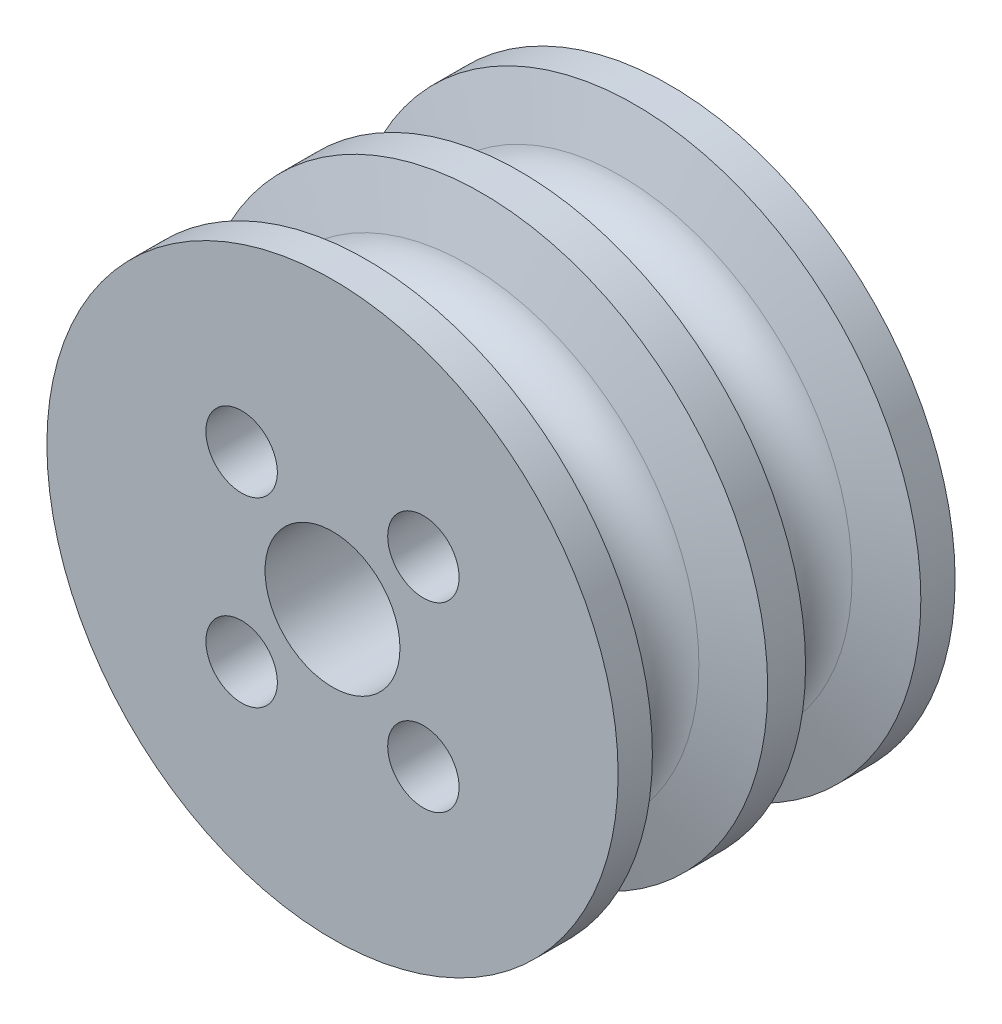
ISO-10303-21;
HEADER;
FILE_DESCRIPTION(('STEP AP214'),'2;1');
FILE_NAME('part.step','',(''),(''),'','','');
FILE_SCHEMA(('AUTOMOTIVE_DESIGN { 1 0 10303 214 1 1 1 1 }'));
ENDSEC;
DATA;
#1=APPLICATION_CONTEXT('core data for automotive mechanical design processes');
#2=APPLICATION_PROTOCOL_DEFINITION('international standard','automotive_design',2000,#1);
#3=PRODUCT_CONTEXT('',#1,'mechanical');
#4=PRODUCT('Part','Part','',(#3));
#5=PRODUCT_RELATED_PRODUCT_CATEGORY('part','',(#4));
#6=PRODUCT_DEFINITION_FORMATION('','',#4);
#7=PRODUCT_DEFINITION_CONTEXT('part definition',#1,'design');
#8=PRODUCT_DEFINITION('design','',#6,#7);
#9=PRODUCT_DEFINITION_SHAPE('','',#8);
#10=(LENGTH_UNIT() NAMED_UNIT(*) SI_UNIT(.MILLI.,.METRE.));
#11=(NAMED_UNIT(*) PLANE_ANGLE_UNIT() SI_UNIT($,.RADIAN.));
#12=(NAMED_UNIT(*) SI_UNIT($,.STERADIAN.) SOLID_ANGLE_UNIT());
#13=UNCERTAINTY_MEASURE_WITH_UNIT(LENGTH_MEASURE(1.E-05),#10,'distance_accuracy_value','');
#14=(GEOMETRIC_REPRESENTATION_CONTEXT(3) GLOBAL_UNCERTAINTY_ASSIGNED_CONTEXT((#13)) GLOBAL_UNIT_ASSIGNED_CONTEXT((#10,
#11,#12)) REPRESENTATION_CONTEXT('',''));
#15=CARTESIAN_POINT('',(0.,0.,0.));
#16=DIRECTION('',(0.,0.,1.));
#17=DIRECTION('',(1.,0.,0.));
#18=AXIS2_PLACEMENT_3D('',#15,#16,#17);
#19=CARTESIAN_POINT('',(0.,0.,3.4050435850451));
#20=DIRECTION('',(0.,0.,1.));
#21=DIRECTION('',(1.,0.,0.));
#22=AXIS2_PLACEMENT_3D('',#19,#20,#21);
#23=TOROIDAL_SURFACE('',#22,10.8011479498745,1.984375);
#24=CARTESIAN_POINT('',(0.,0.,5.32180264658747));
#25=DIRECTION('',(0.,0.,1.));
#26=DIRECTION('',(1.,0.,0.));
#27=AXIS2_PLACEMENT_3D('',#24,#25,#26);
#28=CIRCLE('',#27,10.2875539072492);
#29=CARTESIAN_POINT('',(10.2875539072492,0.,5.32180264658747));
#30=VERTEX_POINT('',#29);
#31=EDGE_CURVE('E10',#30,#30,#28,.T.);
#32=ORIENTED_EDGE('',*,*,#31,.F.);
#33=EDGE_LOOP('',(#32));
#34=FACE_BOUND('',#33,.T.);
#35=CARTESIAN_POINT('',(0.,0.,1.48828452350272));
#36=DIRECTION('',(0.,0.,1.));
#37=DIRECTION('',(1.,0.,0.));
#38=AXIS2_PLACEMENT_3D('',#35,#36,#37);
#39=CIRCLE('',#38,10.2875539072492);
#40=CARTESIAN_POINT('',(10.2875539072492,0.,1.48828452350272));
#41=VERTEX_POINT('',#40);
#42=EDGE_CURVE('E77',#41,#41,#39,.T.);
#43=ORIENTED_EDGE('',*,*,#42,.T.);
#44=EDGE_LOOP('',(#43));
#45=FACE_BOUND('',#44,.T.);
#46=ADVANCED_FACE('F31',(#34,#45),#23,.F.);
#47=CARTESIAN_POINT('',(0.,0.,5.32180264658747));
#48=DIRECTION('',(0.,0.,1.));
#49=DIRECTION('',(1.,0.,0.));
#50=AXIS2_PLACEMENT_3D('',#47,#48,#49);
#51=CONICAL_SURFACE('',#50,10.2875539072492,1.30899693899575);
#52=CARTESIAN_POINT('',(0.,0.,5.96821562892365));
#53=DIRECTION('',(0.,0.,1.));
#54=DIRECTION('',(1.,0.,0.));
#55=AXIS2_PLACEMENT_3D('',#52,#53,#54);
#56=CIRCLE('',#55,12.7);
#57=CARTESIAN_POINT('',(12.7,0.,5.96821562892365));
#58=VERTEX_POINT('',#57);
#59=EDGE_CURVE('E37',#58,#58,#56,.T.);
#60=ORIENTED_EDGE('',*,*,#59,.F.);
#61=EDGE_LOOP('',(#60));
#62=FACE_BOUND('',#61,.T.);
#63=ORIENTED_EDGE('',*,*,#31,.T.);
#64=EDGE_LOOP('',(#63));
#65=FACE_BOUND('',#64,.T.);
#66=ADVANCED_FACE('F149',(#62,#65),#51,.T.);
#67=CARTESIAN_POINT('',(0.,0.,0.));
#68=DIRECTION('',(0.,0.,1.));
#69=DIRECTION('',(1.,0.,0.));
#70=AXIS2_PLACEMENT_3D('',#67,#68,#69);
#71=CYLINDRICAL_SURFACE('',#70,12.7);
#72=CARTESIAN_POINT('',(0.,0.,7.49221562892365));
#73=DIRECTION('',(0.,0.,1.));
#74=DIRECTION('',(1.,0.,0.));
#75=AXIS2_PLACEMENT_3D('',#72,#73,#74);
#76=CIRCLE('',#75,12.7);
#77=CARTESIAN_POINT('',(12.7,0.,7.49221562892365));
#78=VERTEX_POINT('',#77);
#79=EDGE_CURVE('E41',#78,#78,#76,.T.);
#80=ORIENTED_EDGE('',*,*,#79,.F.);
#81=EDGE_LOOP('',(#80));
#82=FACE_BOUND('',#81,.T.);
#83=ORIENTED_EDGE('',*,*,#59,.T.);
#84=EDGE_LOOP('',(#83));
#85=FACE_BOUND('',#84,.T.);
#86=ADVANCED_FACE('F143',(#82,#85),#71,.T.);
#87=CARTESIAN_POINT('',(0.,12.7,7.49221562892365));
#88=DIRECTION('',(0.,0.,-1.));
#89=DIRECTION('',(-1.,0.,0.));
#90=AXIS2_PLACEMENT_3D('',#87,#88,#89);
#91=PLANE('',#90);
#92=CARTESIAN_POINT('',(4.04111525448112,-4.04111525448112,7.49221562892365));
#93=DIRECTION('',(0.,0.,-1.));
#94=DIRECTION('',(-1.,0.,0.));
#95=AXIS2_PLACEMENT_3D('',#92,#93,#94);
#96=CIRCLE('',#95,1.5875);
#97=CARTESIAN_POINT('',(2.45361525448112,-4.04111525448112,7.49221562892365));
#98=VERTEX_POINT('',#97);
#99=EDGE_CURVE('E86',#98,#98,#96,.F.);
#100=ORIENTED_EDGE('',*,*,#99,.F.);
#101=EDGE_LOOP('',(#100));
#102=FACE_BOUND('',#101,.T.);
#103=CARTESIAN_POINT('',(-4.04111525448112,-4.04111525448112,7.49221562892365));
#104=DIRECTION('',(0.,0.,-1.));
#105=DIRECTION('',(-1.,0.,0.));
#106=AXIS2_PLACEMENT_3D('',#103,#104,#105);
#107=CIRCLE('',#106,1.5875);
#108=CARTESIAN_POINT('',(-5.62861525448112,-4.04111525448112,7.49221562892365));
#109=VERTEX_POINT('',#108);
#110=EDGE_CURVE('E94',#109,#109,#107,.F.);
#111=ORIENTED_EDGE('',*,*,#110,.F.);
#112=EDGE_LOOP('',(#111));
#113=FACE_BOUND('',#112,.T.);
#114=CARTESIAN_POINT('',(-4.04111525448112,4.04111525448112,7.49221562892365));
#115=DIRECTION('',(0.,0.,-1.));
#116=DIRECTION('',(-1.,0.,0.));
#117=AXIS2_PLACEMENT_3D('',#114,#115,#116);
#118=CIRCLE('',#117,1.5875);
#119=CARTESIAN_POINT('',(-5.62861525448112,4.04111525448112,7.49221562892365));
#120=VERTEX_POINT('',#119);
#121=EDGE_CURVE('E87',#120,#120,#118,.F.);
#122=ORIENTED_EDGE('',*,*,#121,.F.);
#123=EDGE_LOOP('',(#122));
#124=FACE_BOUND('',#123,.T.);
#125=CARTESIAN_POINT('',(4.04111525448112,4.04111525448112,7.49221562892365));
#126=DIRECTION('',(0.,0.,-1.));
#127=DIRECTION('',(-1.,0.,0.));
#128=AXIS2_PLACEMENT_3D('',#125,#126,#127);
#129=CIRCLE('',#128,1.5875);
#130=CARTESIAN_POINT('',(2.45361525448112,4.04111525448112,7.49221562892365));
#131=VERTEX_POINT('',#130);
#132=EDGE_CURVE('E80',#131,#131,#129,.F.);
#133=ORIENTED_EDGE('',*,*,#132,.F.);
#134=EDGE_LOOP('',(#133));
#135=FACE_BOUND('',#134,.T.);
#136=CARTESIAN_POINT('',(0.,0.,7.49221562892365));
#137=DIRECTION('',(0.,0.,1.));
#138=DIRECTION('',(1.,0.,0.));
#139=AXIS2_PLACEMENT_3D('',#136,#137,#138);
#140=CIRCLE('',#139,3.);
#141=CARTESIAN_POINT('',(3.,0.,7.49221562892365));
#142=VERTEX_POINT('',#141);
#143=EDGE_CURVE('E45',#142,#142,#140,.T.);
#144=ORIENTED_EDGE('',*,*,#143,.F.);
#145=EDGE_LOOP('',(#144));
#146=FACE_BOUND('',#145,.T.);
#147=ORIENTED_EDGE('',*,*,#79,.T.);
#148=EDGE_LOOP('',(#147));
#149=FACE_BOUND('',#148,.T.);
#150=ADVANCED_FACE('F137',(#102,#113,#124,#135,#146,#149),#91,.F.);
#151=CARTESIAN_POINT('',(0.,0.,0.));
#152=DIRECTION('',(0.,0.,1.));
#153=DIRECTION('',(1.,0.,0.));
#154=AXIS2_PLACEMENT_3D('',#151,#152,#153);
#155=CYLINDRICAL_SURFACE('',#154,3.);
#156=CARTESIAN_POINT('',(0.,0.,-4.49221562898415));
#157=DIRECTION('',(0.,0.,1.));
#158=DIRECTION('',(1.,0.,0.));
#159=AXIS2_PLACEMENT_3D('',#156,#157,#158);
#160=CIRCLE('',#159,3.);
#161=CARTESIAN_POINT('',(3.,0.,-4.49221562898415));
#162=VERTEX_POINT('',#161);
#163=EDGE_CURVE('E50',#162,#162,#160,.T.);
#164=ORIENTED_EDGE('',*,*,#163,.F.);
#165=EDGE_LOOP('',(#164));
#166=FACE_BOUND('',#165,.T.);
#167=ORIENTED_EDGE('',*,*,#143,.T.);
#168=EDGE_LOOP('',(#167));
#169=FACE_BOUND('',#168,.T.);
#170=ADVANCED_FACE('F131',(#166,#169),#155,.F.);
#171=CARTESIAN_POINT('',(0.,4.127000001,-4.49221562898415));
#172=DIRECTION('',(0.,0.,1.));
#173=DIRECTION('',(1.,0.,0.));
#174=AXIS2_PLACEMENT_3D('',#171,#172,#173);
#175=PLANE('',#174);
#176=CARTESIAN_POINT('',(0.,0.,-4.49221562898415));
#177=DIRECTION('',(0.,0.,1.));
#178=DIRECTION('',(1.,0.,0.));
#179=AXIS2_PLACEMENT_3D('',#176,#177,#178);
#180=CIRCLE('',#179,4.127000001);
#181=CARTESIAN_POINT('',(4.127000001,0.,-4.49221562898415));
#182=VERTEX_POINT('',#181);
#183=EDGE_CURVE('E53',#182,#182,#180,.T.);
#184=ORIENTED_EDGE('',*,*,#183,.F.);
#185=EDGE_LOOP('',(#184));
#186=FACE_BOUND('',#185,.T.);
#187=ORIENTED_EDGE('',*,*,#163,.T.);
#188=EDGE_LOOP('',(#187));
#189=FACE_BOUND('',#188,.T.);
#190=ADVANCED_FACE('F125',(#186,#189),#175,.F.);
#191=CARTESIAN_POINT('',(0.,0.,0.));
#192=DIRECTION('',(0.,0.,1.));
#193=DIRECTION('',(1.,0.,0.));
#194=AXIS2_PLACEMENT_3D('',#191,#192,#193);
#195=CYLINDRICAL_SURFACE('',#194,4.127000001);
#196=CARTESIAN_POINT('',(0.,0.,-7.49221562898415));
#197=DIRECTION('',(0.,0.,1.));
#198=DIRECTION('',(1.,0.,0.));
#199=AXIS2_PLACEMENT_3D('',#196,#197,#198);
#200=CIRCLE('',#199,4.127000001);
#201=CARTESIAN_POINT('',(4.127000001,0.,-7.49221562898415));
#202=VERTEX_POINT('',#201);
#203=EDGE_CURVE('E56',#202,#202,#200,.T.);
#204=ORIENTED_EDGE('',*,*,#203,.F.);
#205=EDGE_LOOP('',(#204));
#206=FACE_BOUND('',#205,.T.);
#207=ORIENTED_EDGE('',*,*,#183,.T.);
#208=EDGE_LOOP('',(#207));
#209=FACE_BOUND('',#208,.T.);
#210=ADVANCED_FACE('F111',(#206,#209),#195,.F.);
#211=CARTESIAN_POINT('',(0.,12.7,-7.49221562898415));
#212=DIRECTION('',(0.,0.,1.));
#213=DIRECTION('',(1.,0.,0.));
#214=AXIS2_PLACEMENT_3D('',#211,#212,#213);
#215=PLANE('',#214);
#216=CARTESIAN_POINT('',(4.04111525448112,-4.04111525448112,-7.49221562898415));
#217=DIRECTION('',(0.,0.,-1.));
#218=DIRECTION('',(-1.,0.,0.));
#219=AXIS2_PLACEMENT_3D('',#216,#217,#218);
#220=CIRCLE('',#219,1.5875);
#221=CARTESIAN_POINT('',(2.45361525448112,-4.04111525448112,-7.49221562898415));
#222=VERTEX_POINT('',#221);
#223=EDGE_CURVE('E97',#222,#222,#220,.T.);
#224=ORIENTED_EDGE('',*,*,#223,.F.);
#225=EDGE_LOOP('',(#224));
#226=FACE_BOUND('',#225,.T.);
#227=CARTESIAN_POINT('',(-4.04111525448112,-4.04111525448112,-7.49221562898415));
#228=DIRECTION('',(0.,0.,-1.));
#229=DIRECTION('',(-1.,0.,0.));
#230=AXIS2_PLACEMENT_3D('',#227,#228,#229);
#231=CIRCLE('',#230,1.5875);
#232=CARTESIAN_POINT('',(-5.62861525448112,-4.04111525448112,-7.49221562898415));
#233=VERTEX_POINT('',#232);
#234=EDGE_CURVE('E90',#233,#233,#231,.T.);
#235=ORIENTED_EDGE('',*,*,#234,.F.);
#236=EDGE_LOOP('',(#235));
#237=FACE_BOUND('',#236,.T.);
#238=CARTESIAN_POINT('',(-4.04111525448112,4.04111525448112,-7.49221562898415));
#239=DIRECTION('',(0.,0.,-1.));
#240=DIRECTION('',(-1.,0.,0.));
#241=AXIS2_PLACEMENT_3D('',#238,#239,#240);
#242=CIRCLE('',#241,1.5875);
#243=CARTESIAN_POINT('',(-5.62861525448112,4.04111525448112,-7.49221562898415));
#244=VERTEX_POINT('',#243);
#245=EDGE_CURVE('E91',#244,#244,#242,.T.);
#246=ORIENTED_EDGE('',*,*,#245,.F.);
#247=EDGE_LOOP('',(#246));
#248=FACE_BOUND('',#247,.T.);
#249=CARTESIAN_POINT('',(4.04111525448112,4.04111525448112,-7.49221562898415));
#250=DIRECTION('',(0.,0.,-1.));
#251=DIRECTION('',(-1.,0.,0.));
#252=AXIS2_PLACEMENT_3D('',#249,#250,#251);
#253=CIRCLE('',#252,1.5875);
#254=CARTESIAN_POINT('',(2.45361525448112,4.04111525448112,-7.49221562898415));
#255=VERTEX_POINT('',#254);
#256=EDGE_CURVE('E83',#255,#255,#253,.T.);
#257=ORIENTED_EDGE('',*,*,#256,.F.);
#258=EDGE_LOOP('',(#257));
#259=FACE_BOUND('',#258,.T.);
#260=CARTESIAN_POINT('',(0.,0.,-7.49221562898415));
#261=DIRECTION('',(0.,0.,1.));
#262=DIRECTION('',(1.,0.,0.));
#263=AXIS2_PLACEMENT_3D('',#260,#261,#262);
#264=CIRCLE('',#263,12.7);
#265=CARTESIAN_POINT('',(12.7,0.,-7.49221562898415));
#266=VERTEX_POINT('',#265);
#267=EDGE_CURVE('E59',#266,#266,#264,.T.);
#268=ORIENTED_EDGE('',*,*,#267,.F.);
#269=EDGE_LOOP('',(#268));
#270=FACE_BOUND('',#269,.T.);
#271=ORIENTED_EDGE('',*,*,#203,.T.);
#272=EDGE_LOOP('',(#271));
#273=FACE_BOUND('',#272,.T.);
#274=ADVANCED_FACE('F107',(#226,#237,#248,#259,#270,#273),#215,.F.);
#275=CARTESIAN_POINT('',(0.,0.,0.));
#276=DIRECTION('',(0.,0.,1.));
#277=DIRECTION('',(1.,0.,0.));
#278=AXIS2_PLACEMENT_3D('',#275,#276,#277);
#279=CYLINDRICAL_SURFACE('',#278,12.7);
#280=CARTESIAN_POINT('',(0.,0.,-5.96821562898415));
#281=DIRECTION('',(0.,0.,1.));
#282=DIRECTION('',(1.,0.,0.));
#283=AXIS2_PLACEMENT_3D('',#280,#281,#282);
#284=CIRCLE('',#283,12.7);
#285=CARTESIAN_POINT('',(12.7,0.,-5.96821562898415));
#286=VERTEX_POINT('',#285);
#287=EDGE_CURVE('E62',#286,#286,#284,.T.);
#288=ORIENTED_EDGE('',*,*,#287,.F.);
#289=EDGE_LOOP('',(#288));
#290=FACE_BOUND('',#289,.T.);
#291=ORIENTED_EDGE('',*,*,#267,.T.);
#292=EDGE_LOOP('',(#291));
#293=FACE_BOUND('',#292,.T.);
#294=ADVANCED_FACE('F110',(#290,#293),#279,.T.);
#295=CARTESIAN_POINT('',(0.,0.,-5.96821562898415));
#296=DIRECTION('',(0.,0.,-1.));
#297=DIRECTION('',(-1.,0.,0.));
#298=AXIS2_PLACEMENT_3D('',#295,#296,#297);
#299=CONICAL_SURFACE('',#298,12.7,1.30899693899575);
#300=CARTESIAN_POINT('',(0.,0.,-5.32180264664796));
#301=DIRECTION('',(0.,0.,1.));
#302=DIRECTION('',(1.,0.,0.));
#303=AXIS2_PLACEMENT_3D('',#300,#301,#302);
#304=CIRCLE('',#303,10.2875539072492);
#305=CARTESIAN_POINT('',(10.2875539072492,0.,-5.32180264664796));
#306=VERTEX_POINT('',#305);
#307=EDGE_CURVE('E65',#306,#306,#304,.T.);
#308=ORIENTED_EDGE('',*,*,#307,.F.);
#309=EDGE_LOOP('',(#308));
#310=FACE_BOUND('',#309,.T.);
#311=ORIENTED_EDGE('',*,*,#287,.T.);
#312=EDGE_LOOP('',(#311));
#313=FACE_BOUND('',#312,.T.);
#314=ADVANCED_FACE('F184',(#310,#313),#299,.T.);
#315=CARTESIAN_POINT('',(0.,0.,-3.40504358510559));
#316=DIRECTION('',(0.,0.,1.));
#317=DIRECTION('',(1.,0.,0.));
#318=AXIS2_PLACEMENT_3D('',#315,#316,#317);
#319=TOROIDAL_SURFACE('',#318,10.8011479498745,1.984375);
#320=CARTESIAN_POINT('',(0.,0.,-1.48828452356322));
#321=DIRECTION('',(0.,0.,1.));
#322=DIRECTION('',(1.,0.,0.));
#323=AXIS2_PLACEMENT_3D('',#320,#321,#322);
#324=CIRCLE('',#323,10.2875539072492);
#325=CARTESIAN_POINT('',(10.2875539072492,0.,-1.48828452356322));
#326=VERTEX_POINT('',#325);
#327=EDGE_CURVE('E68',#326,#326,#324,.T.);
#328=ORIENTED_EDGE('',*,*,#327,.F.);
#329=EDGE_LOOP('',(#328));
#330=FACE_BOUND('',#329,.T.);
#331=ORIENTED_EDGE('',*,*,#307,.T.);
#332=EDGE_LOOP('',(#331));
#333=FACE_BOUND('',#332,.T.);
#334=ADVANCED_FACE('F178',(#330,#333),#319,.F.);
#335=CARTESIAN_POINT('',(0.,0.,-1.48828452356322));
#336=DIRECTION('',(0.,0.,1.));
#337=DIRECTION('',(1.,0.,0.));
#338=AXIS2_PLACEMENT_3D('',#335,#336,#337);
#339=CONICAL_SURFACE('',#338,10.2875539072492,1.30899693899575);
#340=CARTESIAN_POINT('',(0.,0.,-0.841871541227031));
#341=DIRECTION('',(0.,0.,1.));
#342=DIRECTION('',(1.,0.,0.));
#343=AXIS2_PLACEMENT_3D('',#340,#341,#342);
#344=CIRCLE('',#343,12.7);
#345=CARTESIAN_POINT('',(12.7,0.,-0.841871541227031));
#346=VERTEX_POINT('',#345);
#347=EDGE_CURVE('E71',#346,#346,#344,.T.);
#348=ORIENTED_EDGE('',*,*,#347,.F.);
#349=EDGE_LOOP('',(#348));
#350=FACE_BOUND('',#349,.T.);
#351=ORIENTED_EDGE('',*,*,#327,.T.);
#352=EDGE_LOOP('',(#351));
#353=FACE_BOUND('',#352,.T.);
#354=ADVANCED_FACE('F172',(#350,#353),#339,.T.);
#355=CARTESIAN_POINT('',(0.,0.,0.));
#356=DIRECTION('',(0.,0.,1.));
#357=DIRECTION('',(1.,0.,0.));
#358=AXIS2_PLACEMENT_3D('',#355,#356,#357);
#359=CYLINDRICAL_SURFACE('',#358,12.7);
#360=CARTESIAN_POINT('',(0.,0.,0.841871541166538));
#361=DIRECTION('',(0.,0.,1.));
#362=DIRECTION('',(1.,0.,0.));
#363=AXIS2_PLACEMENT_3D('',#360,#361,#362);
#364=CIRCLE('',#363,12.7);
#365=CARTESIAN_POINT('',(12.7,0.,0.841871541166538));
#366=VERTEX_POINT('',#365);
#367=EDGE_CURVE('E74',#366,#366,#364,.T.);
#368=ORIENTED_EDGE('',*,*,#367,.F.);
#369=EDGE_LOOP('',(#368));
#370=FACE_BOUND('',#369,.T.);
#371=ORIENTED_EDGE('',*,*,#347,.T.);
#372=EDGE_LOOP('',(#371));
#373=FACE_BOUND('',#372,.T.);
#374=ADVANCED_FACE('F166',(#370,#373),#359,.T.);
#375=CARTESIAN_POINT('',(0.,0.,0.841871541166538));
#376=DIRECTION('',(0.,0.,-1.));
#377=DIRECTION('',(-1.,0.,0.));
#378=AXIS2_PLACEMENT_3D('',#375,#376,#377);
#379=CONICAL_SURFACE('',#378,12.7,1.30899693899575);
#380=ORIENTED_EDGE('',*,*,#42,.F.);
#381=EDGE_LOOP('',(#380));
#382=FACE_BOUND('',#381,.T.);
#383=ORIENTED_EDGE('',*,*,#367,.T.);
#384=EDGE_LOOP('',(#383));
#385=FACE_BOUND('',#384,.T.);
#386=ADVANCED_FACE('F162',(#382,#385),#379,.T.);
#387=CARTESIAN_POINT('',(4.04111525448112,4.04111525448112,11.9823436894582));
#388=DIRECTION('',(0.,0.,-1.));
#389=DIRECTION('',(-1.,0.,0.));
#390=AXIS2_PLACEMENT_3D('',#387,#388,#389);
#391=CYLINDRICAL_SURFACE('',#390,1.5875);
#392=ORIENTED_EDGE('',*,*,#132,.T.);
#393=EDGE_LOOP('',(#392));
#394=FACE_BOUND('',#393,.T.);
#395=ORIENTED_EDGE('',*,*,#256,.T.);
#396=EDGE_LOOP('',(#395));
#397=FACE_BOUND('',#396,.T.);
#398=ADVANCED_FACE('F165',(#394,#397),#391,.F.);
#399=CARTESIAN_POINT('',(-4.04111525448112,4.04111525448112,11.9823436894582));
#400=DIRECTION('',(0.,0.,-1.));
#401=DIRECTION('',(-1.,0.,0.));
#402=AXIS2_PLACEMENT_3D('',#399,#400,#401);
#403=CYLINDRICAL_SURFACE('',#402,1.5875);
#404=ORIENTED_EDGE('',*,*,#121,.T.);
#405=EDGE_LOOP('',(#404));
#406=FACE_BOUND('',#405,.T.);
#407=ORIENTED_EDGE('',*,*,#245,.T.);
#408=EDGE_LOOP('',(#407));
#409=FACE_BOUND('',#408,.T.);
#410=ADVANCED_FACE('F201',(#406,#409),#403,.F.);
#411=CARTESIAN_POINT('',(-4.04111525448112,-4.04111525448112,11.9823436894582));
#412=DIRECTION('',(0.,0.,-1.));
#413=DIRECTION('',(-1.,0.,0.));
#414=AXIS2_PLACEMENT_3D('',#411,#412,#413);
#415=CYLINDRICAL_SURFACE('',#414,1.5875);
#416=ORIENTED_EDGE('',*,*,#110,.T.);
#417=EDGE_LOOP('',(#416));
#418=FACE_BOUND('',#417,.T.);
#419=ORIENTED_EDGE('',*,*,#234,.T.);
#420=EDGE_LOOP('',(#419));
#421=FACE_BOUND('',#420,.T.);
#422=ADVANCED_FACE('F205',(#418,#421),#415,.F.);
#423=CARTESIAN_POINT('',(4.04111525448112,-4.04111525448112,11.9823436894582));
#424=DIRECTION('',(0.,0.,-1.));
#425=DIRECTION('',(-1.,0.,0.));
#426=AXIS2_PLACEMENT_3D('',#423,#424,#425);
#427=CYLINDRICAL_SURFACE('',#426,1.5875);
#428=ORIENTED_EDGE('',*,*,#99,.T.);
#429=EDGE_LOOP('',(#428));
#430=FACE_BOUND('',#429,.T.);
#431=ORIENTED_EDGE('',*,*,#223,.T.);
#432=EDGE_LOOP('',(#431));
#433=FACE_BOUND('',#432,.T.);
#434=ADVANCED_FACE('F105',(#430,#433),#427,.F.);
#435=CLOSED_SHELL('',(#46,#66,#86,#150,#170,#190,#210,#274,#294,#314,#334,#354,#374,#386,#398,
#410,#422,#434));
#436=MANIFOLD_SOLID_BREP('B2',#435);
#437=ADVANCED_BREP_SHAPE_REPRESENTATION('',(#18,#436),#14);
#438=SHAPE_DEFINITION_REPRESENTATION(#9,#437);
ENDSEC;
END-ISO-10303-21;
